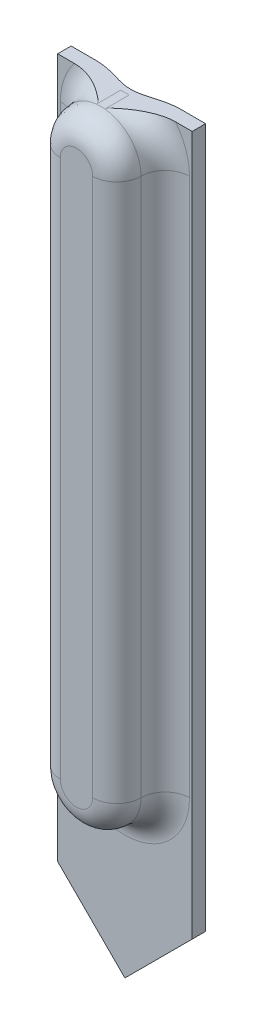
ISO-10303-21;
HEADER;
FILE_DESCRIPTION(('STEP AP214'),'2;1');
FILE_NAME('part.step','',(''),(''),'','','');
FILE_SCHEMA(('AUTOMOTIVE_DESIGN { 1 0 10303 214 1 1 1 1 }'));
ENDSEC;
DATA;
#1=APPLICATION_CONTEXT('core data for automotive mechanical design processes');
#2=APPLICATION_PROTOCOL_DEFINITION('international standard','automotive_design',2000,#1);
#3=PRODUCT_CONTEXT('',#1,'mechanical');
#4=PRODUCT('Part','Part','',(#3));
#5=PRODUCT_RELATED_PRODUCT_CATEGORY('part','',(#4));
#6=PRODUCT_DEFINITION_FORMATION('','',#4);
#7=PRODUCT_DEFINITION_CONTEXT('part definition',#1,'design');
#8=PRODUCT_DEFINITION('design','',#6,#7);
#9=PRODUCT_DEFINITION_SHAPE('','',#8);
#10=(LENGTH_UNIT() NAMED_UNIT(*) SI_UNIT(.MILLI.,.METRE.));
#11=(NAMED_UNIT(*) PLANE_ANGLE_UNIT() SI_UNIT($,.RADIAN.));
#12=(NAMED_UNIT(*) SI_UNIT($,.STERADIAN.) SOLID_ANGLE_UNIT());
#13=UNCERTAINTY_MEASURE_WITH_UNIT(LENGTH_MEASURE(1.E-05),#10,'distance_accuracy_value','');
#14=(GEOMETRIC_REPRESENTATION_CONTEXT(3) GLOBAL_UNCERTAINTY_ASSIGNED_CONTEXT((#13)) GLOBAL_UNIT_ASSIGNED_CONTEXT((#10,
#11,#12)) REPRESENTATION_CONTEXT('',''));
#15=CARTESIAN_POINT('',(0.,0.,0.));
#16=DIRECTION('',(0.,0.,1.));
#17=DIRECTION('',(1.,0.,0.));
#18=AXIS2_PLACEMENT_3D('',#15,#16,#17);
#19=CARTESIAN_POINT('',(10.37274519616,0.9,-14.73102915295));
#20=DIRECTION('',(0.,0.,1.));
#21=DIRECTION('',(1.,0.,0.));
#22=AXIS2_PLACEMENT_3D('',#19,#20,#21);
#23=PLANE('',#22);
#24=CARTESIAN_POINT('',(10.37274519616,0.9,-14.73102915295));
#25=DIRECTION('',(0.,0.,-1.));
#26=DIRECTION('',(1.,0.,0.));
#27=AXIS2_PLACEMENT_3D('',#24,#25,#26);
#28=CIRCLE('',#27,0.119999999999999);
#29=CARTESIAN_POINT('',(10.49274519616,0.9,-14.73102915295));
#30=VERTEX_POINT('',#29);
#31=CARTESIAN_POINT('',(10.25274519616,0.9,-14.73102915295));
#32=VERTEX_POINT('',#31);
#33=EDGE_CURVE('E509',#30,#32,#28,.T.);
#34=ORIENTED_EDGE('',*,*,#33,.F.);
#35=DIRECTION('',(0.,-1.,0.));
#36=VECTOR('',#35,1.);
#37=CARTESIAN_POINT('',(10.49274519616,0.9,-14.73102915295));
#38=LINE('',#37,#36);
#39=CARTESIAN_POINT('',(10.49274519616,4.901639164853,-14.73102915295));
#40=VERTEX_POINT('',#39);
#41=EDGE_CURVE('E495',#40,#30,#38,.T.);
#42=ORIENTED_EDGE('',*,*,#41,.F.);
#43=CARTESIAN_POINT('',(10.37274519616,4.901639164853,-14.73102915295));
#44=DIRECTION('',(0.,0.,-1.));
#45=DIRECTION('',(-1.,0.,0.));
#46=AXIS2_PLACEMENT_3D('',#43,#44,#45);
#47=CIRCLE('',#46,0.119999999999999);
#48=CARTESIAN_POINT('',(10.25274519616,4.901639164853,-14.73102915295));
#49=VERTEX_POINT('',#48);
#50=EDGE_CURVE('E542',#40,#49,#47,.F.);
#51=ORIENTED_EDGE('',*,*,#50,.T.);
#52=DIRECTION('',(0.,1.,0.));
#53=VECTOR('',#52,1.);
#54=CARTESIAN_POINT('',(10.25274519616,0.9,-14.73102915295));
#55=LINE('',#54,#53);
#56=EDGE_CURVE('E494',#32,#49,#55,.T.);
#57=ORIENTED_EDGE('',*,*,#56,.F.);
#58=EDGE_LOOP('',(#34,#42,#51,#57));
#59=FACE_BOUND('',#58,.T.);
#60=ADVANCED_FACE('F17',(#59),#23,.T.);
#61=CARTESIAN_POINT('',(10.67274519616,0.9,-14.91102915295));
#62=CARTESIAN_POINT('',(10.67274519616,0.9,-14.86390526315));
#63=CARTESIAN_POINT('',(10.657944212677,0.9,-14.81678538282));
#64=CARTESIAN_POINT('',(10.628319423096,0.9,-14.77545492602));
#65=CARTESIAN_POINT('',(10.586988966287,0.9,-14.74583013643));
#66=CARTESIAN_POINT('',(10.539869085964,0.9,-14.73102915295));
#67=CARTESIAN_POINT('',(10.49274519616,0.9,-14.73102915295));
#68=(BOUNDED_CURVE() B_SPLINE_CURVE(6,(#61,#62,#63,#64,#65,#66,#67),.UNSPECIFIED.,.F.,
.F.) B_SPLINE_CURVE_WITH_KNOTS((7,7),(0.,1.570796326795),
.UNSPECIFIED.) CURVE() GEOMETRIC_REPRESENTATION_ITEM() RATIONAL_B_SPLINE_CURVE((1.,1.,1.,1.,1.,
1.,1.)) REPRESENTATION_ITEM(''));
#69=CARTESIAN_POINT('',(10.37274519616,0.9,-14.91102915295));
#70=DIRECTION('',(0.,0.,-1.));
#71=AXIS1_PLACEMENT('',#69,#70);
#72=SURFACE_OF_REVOLUTION('',#68,#71);
#73=ORIENTED_EDGE('',*,*,#33,.T.);
#74=CARTESIAN_POINT('',(10.25274519616,0.9,-14.91102915295));
#75=DIRECTION('',(0.,1.,0.));
#76=DIRECTION('',(0.,0.,1.));
#77=AXIS2_PLACEMENT_3D('',#74,#75,#76);
#78=CIRCLE('',#77,0.18);
#79=CARTESIAN_POINT('',(10.07274519616,0.9,-14.91102915295));
#80=VERTEX_POINT('',#79);
#81=EDGE_CURVE('E491',#80,#32,#78,.T.);
#82=ORIENTED_EDGE('',*,*,#81,.F.);
#83=CARTESIAN_POINT('',(10.37274519616,0.9,-14.91102915295));
#84=DIRECTION('',(0.,0.,-1.));
#85=DIRECTION('',(-1.,0.,0.));
#86=AXIS2_PLACEMENT_3D('',#83,#84,#85);
#87=CIRCLE('',#86,0.3);
#88=CARTESIAN_POINT('',(10.67274519616,0.9,-14.91102915295));
#89=VERTEX_POINT('',#88);
#90=EDGE_CURVE('E473',#80,#89,#87,.F.);
#91=ORIENTED_EDGE('',*,*,#90,.T.);
#92=CARTESIAN_POINT('',(10.49274519616,0.9,-14.91102915295));
#93=DIRECTION('',(0.,-1.,0.));
#94=DIRECTION('',(0.,0.,-1.));
#95=AXIS2_PLACEMENT_3D('',#92,#93,#94);
#96=CIRCLE('',#95,0.18);
#97=EDGE_CURVE('E506',#30,#89,#96,.F.);
#98=ORIENTED_EDGE('',*,*,#97,.F.);
#99=EDGE_LOOP('',(#73,#82,#91,#98));
#100=FACE_BOUND('',#99,.T.);
#101=ADVANCED_FACE('F523',(#100),#72,.F.);
#102=CARTESIAN_POINT('',(10.49274519616,0.9,-14.91102915295));
#103=DIRECTION('',(0.,-1.,0.));
#104=DIRECTION('',(0.,0.,-1.));
#105=AXIS2_PLACEMENT_3D('',#102,#103,#104);
#106=CYLINDRICAL_SURFACE('',#105,0.18);
#107=CARTESIAN_POINT('',(10.49274519616,4.901639164853,-14.91102915295));
#108=DIRECTION('',(0.,-1.,0.));
#109=DIRECTION('',(0.,0.,-1.));
#110=AXIS2_PLACEMENT_3D('',#107,#108,#109);
#111=CIRCLE('',#110,0.18);
#112=CARTESIAN_POINT('',(10.67274519616,4.901639164853,-14.91102915295));
#113=VERTEX_POINT('',#112);
#114=EDGE_CURVE('E508',#113,#40,#111,.T.);
#115=ORIENTED_EDGE('',*,*,#114,.T.);
#116=ORIENTED_EDGE('',*,*,#41,.T.);
#117=ORIENTED_EDGE('',*,*,#97,.T.);
#118=DIRECTION('',(0.,-1.,0.));
#119=VECTOR('',#118,1.);
#120=CARTESIAN_POINT('',(10.67274519616,0.9,-14.91102915295));
#121=LINE('',#120,#119);
#122=EDGE_CURVE('E481',#89,#113,#121,.F.);
#123=ORIENTED_EDGE('',*,*,#122,.T.);
#124=EDGE_LOOP('',(#115,#116,#117,#123));
#125=FACE_BOUND('',#124,.T.);
#126=ADVANCED_FACE('F527',(#125),#106,.T.);
#127=CARTESIAN_POINT('',(10.25274519616,0.9,-14.91102915295));
#128=DIRECTION('',(0.,1.,0.));
#129=DIRECTION('',(0.,0.,1.));
#130=AXIS2_PLACEMENT_3D('',#127,#128,#129);
#131=CYLINDRICAL_SURFACE('',#130,0.18);
#132=CARTESIAN_POINT('',(10.25274519616,4.901639164853,-14.91102915295));
#133=DIRECTION('',(0.,1.,0.));
#134=DIRECTION('',(0.,0.,1.));
#135=AXIS2_PLACEMENT_3D('',#132,#133,#134);
#136=CIRCLE('',#135,0.18);
#137=CARTESIAN_POINT('',(10.07274519616,4.901639164853,-14.91102915295));
#138=VERTEX_POINT('',#137);
#139=EDGE_CURVE('E482',#49,#138,#136,.F.);
#140=ORIENTED_EDGE('',*,*,#139,.T.);
#141=DIRECTION('',(0.,1.,0.));
#142=VECTOR('',#141,1.);
#143=CARTESIAN_POINT('',(10.07274519616,0.9,-14.91102915295));
#144=LINE('',#143,#142);
#145=EDGE_CURVE('E485',#138,#80,#144,.F.);
#146=ORIENTED_EDGE('',*,*,#145,.T.);
#147=ORIENTED_EDGE('',*,*,#81,.T.);
#148=ORIENTED_EDGE('',*,*,#56,.T.);
#149=EDGE_LOOP('',(#140,#146,#147,#148));
#150=FACE_BOUND('',#149,.T.);
#151=ADVANCED_FACE('F766',(#150),#131,.T.);
#152=CARTESIAN_POINT('',(10.37274519616,0.9,-14.91102915295));
#153=DIRECTION('',(0.,0.,-1.));
#154=DIRECTION('',(-1.,0.,0.));
#155=AXIS2_PLACEMENT_3D('',#152,#153,#154);
#156=TOROIDAL_SURFACE('',#155,0.48,0.18);
#157=ORIENTED_EDGE('',*,*,#90,.F.);
#158=CARTESIAN_POINT('',(9.89274519616,0.9,-14.91102915295));
#159=DIRECTION('',(0.,1.,0.));
#160=DIRECTION('',(0.,0.,1.));
#161=AXIS2_PLACEMENT_3D('',#158,#159,#160);
#162=CIRCLE('',#161,0.18);
#163=CARTESIAN_POINT('',(9.89274519616,0.9,-15.09102915295));
#164=VERTEX_POINT('',#163);
#165=EDGE_CURVE('E488',#80,#164,#162,.T.);
#166=ORIENTED_EDGE('',*,*,#165,.T.);
#167=CARTESIAN_POINT('',(10.37274519616,0.9,-15.09102915295));
#168=DIRECTION('',(0.,0.,1.));
#169=DIRECTION('',(-1.,0.,0.));
#170=AXIS2_PLACEMENT_3D('',#167,#168,#169);
#171=CIRCLE('',#170,0.48);
#172=CARTESIAN_POINT('',(10.85274519616,0.9,-15.09102915295));
#173=VERTEX_POINT('',#172);
#174=EDGE_CURVE('E434',#164,#173,#171,.T.);
#175=ORIENTED_EDGE('',*,*,#174,.T.);
#176=CARTESIAN_POINT('',(10.85274519616,0.9,-14.91102915295));
#177=DIRECTION('',(0.,-1.,0.));
#178=DIRECTION('',(0.,0.,-1.));
#179=AXIS2_PLACEMENT_3D('',#176,#177,#178);
#180=CIRCLE('',#179,0.18);
#181=EDGE_CURVE('E749',#173,#89,#180,.F.);
#182=ORIENTED_EDGE('',*,*,#181,.T.);
#183=EDGE_LOOP('',(#157,#166,#175,#182));
#184=FACE_BOUND('',#183,.T.);
#185=ADVANCED_FACE('F745',(#184),#156,.F.);
#186=CARTESIAN_POINT('',(10.85274519616,0.9,-14.91102915295));
#187=DIRECTION('',(0.,-1.,0.));
#188=DIRECTION('',(0.,0.,-1.));
#189=AXIS2_PLACEMENT_3D('',#186,#187,#188);
#190=CYLINDRICAL_SURFACE('',#189,0.18);
#191=DIRECTION('',(0.,1.,0.));
#192=VECTOR('',#191,1.);
#193=CARTESIAN_POINT('',(10.85274519616,5.2,-15.09102915295));
#194=LINE('',#193,#192);
#195=CARTESIAN_POINT('',(10.8527451961601,4.901639164853,-15.09102915295));
#196=VERTEX_POINT('',#195);
#197=EDGE_CURVE('E395',#173,#196,#194,.T.);
#198=ORIENTED_EDGE('',*,*,#197,.T.);
#199=CARTESIAN_POINT('',(10.85274519616,4.901639164853,-14.91102915295));
#200=DIRECTION('',(0.,-1.,0.));
#201=DIRECTION('',(0.,0.,-1.));
#202=AXIS2_PLACEMENT_3D('',#199,#200,#201);
#203=CIRCLE('',#202,0.18);
#204=EDGE_CURVE('E503',#113,#196,#203,.T.);
#205=ORIENTED_EDGE('',*,*,#204,.F.);
#206=ORIENTED_EDGE('',*,*,#122,.F.);
#207=ORIENTED_EDGE('',*,*,#181,.F.);
#208=EDGE_LOOP('',(#198,#205,#206,#207));
#209=FACE_BOUND('',#208,.T.);
#210=ADVANCED_FACE('F765',(#209),#190,.F.);
#211=CARTESIAN_POINT('',(9.89274519616,0.9,-14.91102915295));
#212=DIRECTION('',(0.,1.,0.));
#213=DIRECTION('',(0.,0.,1.));
#214=AXIS2_PLACEMENT_3D('',#211,#212,#213);
#215=CYLINDRICAL_SURFACE('',#214,0.18);
#216=ORIENTED_EDGE('',*,*,#145,.F.);
#217=CARTESIAN_POINT('',(9.89274519616,4.901639164853,-14.91102915295));
#218=DIRECTION('',(0.,1.,0.));
#219=DIRECTION('',(0.,0.,1.));
#220=AXIS2_PLACEMENT_3D('',#217,#218,#219);
#221=CIRCLE('',#220,0.18);
#222=CARTESIAN_POINT('',(9.89274519616,4.901639164853,-15.09102915295));
#223=VERTEX_POINT('',#222);
#224=EDGE_CURVE('E164',#223,#138,#221,.F.);
#225=ORIENTED_EDGE('',*,*,#224,.F.);
#226=DIRECTION('',(0.,1.,0.));
#227=VECTOR('',#226,1.);
#228=CARTESIAN_POINT('',(9.89274519616,5.2,-15.09102915295));
#229=LINE('',#228,#227);
#230=EDGE_CURVE('E170',#223,#164,#229,.F.);
#231=ORIENTED_EDGE('',*,*,#230,.T.);
#232=ORIENTED_EDGE('',*,*,#165,.F.);
#233=EDGE_LOOP('',(#216,#225,#231,#232));
#234=FACE_BOUND('',#233,.T.);
#235=ADVANCED_FACE('F555',(#234),#215,.F.);
#236=CARTESIAN_POINT('',(10.67274519616,4.901639164853,-14.91102915295));
#237=CARTESIAN_POINT('',(10.67274519616,4.901639164853,-14.86390526315));
#238=CARTESIAN_POINT('',(10.657944212677,4.901639164853,-14.81678538282));
#239=CARTESIAN_POINT('',(10.628319423096,4.901639164853,-14.77545492602));
#240=CARTESIAN_POINT('',(10.586988966287,4.901639164853,-14.74583013643));
#241=CARTESIAN_POINT('',(10.539869085964,4.901639164853,-14.73102915295));
#242=CARTESIAN_POINT('',(10.49274519616,4.901639164853,-14.73102915295));
#243=(BOUNDED_CURVE() B_SPLINE_CURVE(6,(#236,#237,#238,#239,#240,#241,#242),.UNSPECIFIED.,.F.,
.F.) B_SPLINE_CURVE_WITH_KNOTS((7,7),(0.,1.570796326795),
.UNSPECIFIED.) CURVE() GEOMETRIC_REPRESENTATION_ITEM() RATIONAL_B_SPLINE_CURVE((1.,1.,1.,1.,1.,
1.,1.)) REPRESENTATION_ITEM(''));
#244=CARTESIAN_POINT('',(10.37274519616,4.901639164853,-14.91102915295));
#245=DIRECTION('',(0.,0.,-1.));
#246=AXIS1_PLACEMENT('',#244,#245);
#247=SURFACE_OF_REVOLUTION('',#243,#246);
#248=ORIENTED_EDGE('',*,*,#50,.F.);
#249=ORIENTED_EDGE('',*,*,#114,.F.);
#250=CARTESIAN_POINT('',(10.37274519616,4.901639164853,-14.91102915295));
#251=DIRECTION('',(0.,0.,-1.));
#252=DIRECTION('',(-1.,0.,0.));
#253=AXIS2_PLACEMENT_3D('',#250,#251,#252);
#254=CIRCLE('',#253,0.3);
#255=CARTESIAN_POINT('',(10.4040631151635,5.19999999999949,-14.91102915295));
#256=VERTEX_POINT('',#255);
#257=EDGE_CURVE('E187',#113,#256,#254,.F.);
#258=ORIENTED_EDGE('',*,*,#257,.T.);
#259=CARTESIAN_POINT('',(10.37274519616,4.901639164853,-14.91102915295));
#260=DIRECTION('',(0.,0.,-1.));
#261=DIRECTION('',(-1.,0.,0.));
#262=AXIS2_PLACEMENT_3D('',#259,#260,#261);
#263=CIRCLE('',#262,0.3);
#264=CARTESIAN_POINT('',(10.3414272771568,5.19999999999949,-14.91102915295));
#265=VERTEX_POINT('',#264);
#266=EDGE_CURVE('E183',#265,#256,#263,.T.);
#267=ORIENTED_EDGE('',*,*,#266,.F.);
#268=CARTESIAN_POINT('',(10.37274519616,4.901639164853,-14.91102915295));
#269=DIRECTION('',(0.,0.,-1.));
#270=DIRECTION('',(-1.,0.,0.));
#271=AXIS2_PLACEMENT_3D('',#268,#269,#270);
#272=CIRCLE('',#271,0.3);
#273=EDGE_CURVE('E159',#265,#138,#272,.F.);
#274=ORIENTED_EDGE('',*,*,#273,.T.);
#275=ORIENTED_EDGE('',*,*,#139,.F.);
#276=EDGE_LOOP('',(#248,#249,#258,#267,#274,#275));
#277=FACE_BOUND('',#276,.T.);
#278=ADVANCED_FACE('F185',(#277),#247,.F.);
#279=CARTESIAN_POINT('',(10.37274519616,0.9,-14.83102915295));
#280=DIRECTION('',(0.,0.,1.));
#281=DIRECTION('',(1.,0.,0.));
#282=AXIS2_PLACEMENT_3D('',#279,#280,#281);
#283=PLANE('',#282);
#284=DIRECTION('',(0.,1.,0.));
#285=VECTOR('',#284,1.);
#286=CARTESIAN_POINT('',(10.44274519616,0.9,-14.83102915295));
#287=LINE('',#286,#285);
#288=CARTESIAN_POINT('',(10.44274519616,4.901639164853,-14.83102915295));
#289=VERTEX_POINT('',#288);
#290=CARTESIAN_POINT('',(10.44274519616,0.9,-14.83102915295));
#291=VERTEX_POINT('',#290);
#292=EDGE_CURVE('E376',#289,#291,#287,.F.);
#293=ORIENTED_EDGE('',*,*,#292,.T.);
#294=CARTESIAN_POINT('',(10.37274519616,0.9,-14.83102915295));
#295=DIRECTION('',(0.,0.,1.));
#296=DIRECTION('',(-1.,0.,0.));
#297=AXIS2_PLACEMENT_3D('',#294,#295,#296);
#298=CIRCLE('',#297,0.0700000000000006);
#299=CARTESIAN_POINT('',(10.30274519616,0.9,-14.83102915295));
#300=VERTEX_POINT('',#299);
#301=EDGE_CURVE('E584',#291,#300,#298,.F.);
#302=ORIENTED_EDGE('',*,*,#301,.T.);
#303=DIRECTION('',(0.,-1.,0.));
#304=VECTOR('',#303,1.);
#305=CARTESIAN_POINT('',(10.30274519616,0.9,-14.83102915295));
#306=LINE('',#305,#304);
#307=CARTESIAN_POINT('',(10.30274519616,4.901639164853,-14.83102915295));
#308=VERTEX_POINT('',#307);
#309=EDGE_CURVE('E447',#300,#308,#306,.F.);
#310=ORIENTED_EDGE('',*,*,#309,.T.);
#311=CARTESIAN_POINT('',(10.37274519616,4.901639164853,-14.83102915295));
#312=DIRECTION('',(0.,0.,1.));
#313=DIRECTION('',(1.,0.,0.));
#314=AXIS2_PLACEMENT_3D('',#311,#312,#313);
#315=CIRCLE('',#314,0.0700000000000006);
#316=EDGE_CURVE('E377',#308,#289,#315,.F.);
#317=ORIENTED_EDGE('',*,*,#316,.T.);
#318=EDGE_LOOP('',(#293,#302,#310,#317));
#319=FACE_BOUND('',#318,.T.);
#320=ADVANCED_FACE('F463',(#319),#283,.F.);
#321=CARTESIAN_POINT('',(10.62274519616,0.9,-15.01102915295));
#322=CARTESIAN_POINT('',(10.62274519616,0.9,-14.96390526315));
#323=CARTESIAN_POINT('',(10.607944212677,0.9,-14.91678538282));
#324=CARTESIAN_POINT('',(10.578319423096,0.9,-14.87545492602));
#325=CARTESIAN_POINT('',(10.536988966287,0.9,-14.84583013643));
#326=CARTESIAN_POINT('',(10.489869085964,0.9,-14.83102915295));
#327=CARTESIAN_POINT('',(10.44274519616,0.9,-14.83102915295));
#328=(BOUNDED_CURVE() B_SPLINE_CURVE(6,(#321,#322,#323,#324,#325,#326,#327),.UNSPECIFIED.,.F.,
.F.) B_SPLINE_CURVE_WITH_KNOTS((7,7),(0.,1.570796326795),
.UNSPECIFIED.) CURVE() GEOMETRIC_REPRESENTATION_ITEM() RATIONAL_B_SPLINE_CURVE((1.,1.,1.,1.,1.,
1.,1.)) REPRESENTATION_ITEM(''));
#329=CARTESIAN_POINT('',(10.37274519616,0.9,-15.01102915295));
#330=DIRECTION('',(0.,0.,-1.));
#331=AXIS1_PLACEMENT('',#329,#330);
#332=SURFACE_OF_REVOLUTION('',#328,#331);
#333=ORIENTED_EDGE('',*,*,#301,.F.);
#334=CARTESIAN_POINT('',(10.44274519616,0.9,-15.01102915295));
#335=DIRECTION('',(0.,1.,0.));
#336=DIRECTION('',(0.,0.,1.));
#337=AXIS2_PLACEMENT_3D('',#334,#335,#336);
#338=CIRCLE('',#337,0.18);
#339=CARTESIAN_POINT('',(10.62274519616,0.9,-15.01102915295));
#340=VERTEX_POINT('',#339);
#341=EDGE_CURVE('E382',#291,#340,#338,.T.);
#342=ORIENTED_EDGE('',*,*,#341,.T.);
#343=CARTESIAN_POINT('',(10.37274519616,0.9,-15.01102915295));
#344=DIRECTION('',(0.,0.,1.));
#345=DIRECTION('',(1.,0.,0.));
#346=AXIS2_PLACEMENT_3D('',#343,#344,#345);
#347=CIRCLE('',#346,0.25);
#348=CARTESIAN_POINT('',(10.12274519616,0.9,-15.01102915295));
#349=VERTEX_POINT('',#348);
#350=EDGE_CURVE('E606',#349,#340,#347,.T.);
#351=ORIENTED_EDGE('',*,*,#350,.F.);
#352=CARTESIAN_POINT('',(10.30274519616,0.9,-15.01102915295));
#353=DIRECTION('',(0.,-1.,0.));
#354=DIRECTION('',(0.,0.,-1.));
#355=AXIS2_PLACEMENT_3D('',#352,#353,#354);
#356=CIRCLE('',#355,0.18);
#357=EDGE_CURVE('E444',#349,#300,#356,.F.);
#358=ORIENTED_EDGE('',*,*,#357,.T.);
#359=EDGE_LOOP('',(#333,#342,#351,#358));
#360=FACE_BOUND('',#359,.T.);
#361=ADVANCED_FACE('F458',(#360),#332,.T.);
#362=CARTESIAN_POINT('',(10.30274519616,0.9,-15.01102915295));
#363=DIRECTION('',(0.,-1.,0.));
#364=DIRECTION('',(0.,0.,-1.));
#365=AXIS2_PLACEMENT_3D('',#362,#363,#364);
#366=CYLINDRICAL_SURFACE('',#365,0.18);
#367=DIRECTION('',(0.,1.,0.));
#368=VECTOR('',#367,1.);
#369=CARTESIAN_POINT('',(10.12274519616,0.9,-15.01102915295));
#370=LINE('',#369,#368);
#371=CARTESIAN_POINT('',(10.12274519616,4.901639164853,-15.01102915295));
#372=VERTEX_POINT('',#371);
#373=EDGE_CURVE('E608',#372,#349,#370,.F.);
#374=ORIENTED_EDGE('',*,*,#373,.F.);
#375=CARTESIAN_POINT('',(10.30274519616,4.901639164853,-15.01102915295));
#376=DIRECTION('',(0.,-1.,0.));
#377=DIRECTION('',(0.,0.,-1.));
#378=AXIS2_PLACEMENT_3D('',#375,#376,#377);
#379=CIRCLE('',#378,0.18);
#380=EDGE_CURVE('E374',#372,#308,#379,.F.);
#381=ORIENTED_EDGE('',*,*,#380,.T.);
#382=ORIENTED_EDGE('',*,*,#309,.F.);
#383=ORIENTED_EDGE('',*,*,#357,.F.);
#384=EDGE_LOOP('',(#374,#381,#382,#383));
#385=FACE_BOUND('',#384,.T.);
#386=ADVANCED_FACE('F462',(#385),#366,.F.);
#387=CARTESIAN_POINT('',(9.87274519616,5.2,-15.09102915295));
#388=DIRECTION('',(0.,0.,-1.));
#389=DIRECTION('',(-1.,0.,0.));
#390=AXIS2_PLACEMENT_3D('',#387,#388,#389);
#391=PLANE('',#390);
#392=CARTESIAN_POINT('',(10.37274519616,4.901639164853,-15.09102915295));
#393=DIRECTION('',(0.,0.,1.));
#394=DIRECTION('',(-0.783346664475921,0.621585073223649,0.));
#395=AXIS2_PLACEMENT_3D('',#392,#393,#394);
#396=CIRCLE('',#395,0.480000000000002);
#397=CARTESIAN_POINT('',(9.99673879721191,5.20000000000007,-15.09102915295));
#398=VERTEX_POINT('',#397);
#399=EDGE_CURVE('E169',#223,#398,#396,.F.);
#400=ORIENTED_EDGE('',*,*,#399,.T.);
#401=DIRECTION('',(-1.,0.,0.));
#402=VECTOR('',#401,1.);
#403=CARTESIAN_POINT('',(9.87274519616,5.2,-15.09102915295));
#404=LINE('',#403,#402);
#405=CARTESIAN_POINT('',(9.87274519616,5.2,-15.09102915295));
#406=VERTEX_POINT('',#405);
#407=EDGE_CURVE('E178',#406,#398,#404,.F.);
#408=ORIENTED_EDGE('',*,*,#407,.F.);
#409=DIRECTION('',(0.,1.,0.));
#410=VECTOR('',#409,1.);
#411=CARTESIAN_POINT('',(9.87274519616,5.2,-15.09102915295));
#412=LINE('',#411,#410);
#413=CARTESIAN_POINT('',(9.87274519616,0.,-15.09102915295));
#414=VERTEX_POINT('',#413);
#415=EDGE_CURVE('E243',#406,#414,#412,.F.);
#416=ORIENTED_EDGE('',*,*,#415,.T.);
#417=DIRECTION('',(-0.707106781186548,0.707106781186548,0.));
#418=VECTOR('',#417,1.);
#419=CARTESIAN_POINT('',(9.87274519616,0.,-15.09102915295));
#420=LINE('',#419,#418);
#421=CARTESIAN_POINT('',(10.37274519616,-0.499999999999999,-15.09102915295));
#422=VERTEX_POINT('',#421);
#423=EDGE_CURVE('E242',#414,#422,#420,.F.);
#424=ORIENTED_EDGE('',*,*,#423,.T.);
#425=DIRECTION('',(-0.707106781186548,-0.707106781186548,0.));
#426=VECTOR('',#425,1.);
#427=CARTESIAN_POINT('',(10.87274519616,0.,-15.09102915295));
#428=LINE('',#427,#426);
#429=CARTESIAN_POINT('',(10.87274519616,0.,-15.09102915295));
#430=VERTEX_POINT('',#429);
#431=EDGE_CURVE('E231',#422,#430,#428,.F.);
#432=ORIENTED_EDGE('',*,*,#431,.T.);
#433=DIRECTION('',(0.,1.,0.));
#434=VECTOR('',#433,1.);
#435=CARTESIAN_POINT('',(10.87274519616,5.2,-15.09102915295));
#436=LINE('',#435,#434);
#437=CARTESIAN_POINT('',(10.87274519616,5.2,-15.09102915295));
#438=VERTEX_POINT('',#437);
#439=EDGE_CURVE('E220',#430,#438,#436,.T.);
#440=ORIENTED_EDGE('',*,*,#439,.T.);
#441=DIRECTION('',(-1.,0.,0.));
#442=VECTOR('',#441,1.);
#443=CARTESIAN_POINT('',(9.87274519616,5.2,-15.09102915295));
#444=LINE('',#443,#442);
#445=CARTESIAN_POINT('',(10.748751595109,5.2,-15.09102915295));
#446=VERTEX_POINT('',#445);
#447=EDGE_CURVE('E398',#446,#438,#444,.F.);
#448=ORIENTED_EDGE('',*,*,#447,.F.);
#449=CARTESIAN_POINT('',(10.37274519616,4.901639164853,-15.09102915295));
#450=DIRECTION('',(0.,0.,1.));
#451=DIRECTION('',(1.,0.,0.));
#452=AXIS2_PLACEMENT_3D('',#449,#450,#451);
#453=CIRCLE('',#452,0.48000000000022);
#454=EDGE_CURVE('E335',#446,#196,#453,.F.);
#455=ORIENTED_EDGE('',*,*,#454,.T.);
#456=ORIENTED_EDGE('',*,*,#197,.F.);
#457=ORIENTED_EDGE('',*,*,#174,.F.);
#458=ORIENTED_EDGE('',*,*,#230,.F.);
#459=EDGE_LOOP('',(#400,#408,#416,#424,#432,#440,#448,#455,#456,#457,#458));
#460=FACE_BOUND('',#459,.T.);
#461=ADVANCED_FACE('F360',(#460),#391,.F.);
#462=CARTESIAN_POINT('',(10.37274519616,4.901639164853,-14.91102915295));
#463=DIRECTION('',(0.,0.,-1.));
#464=DIRECTION('',(-1.,0.,0.));
#465=AXIS2_PLACEMENT_3D('',#462,#463,#464);
#466=TOROIDAL_SURFACE('',#465,0.48,0.18);
#467=ORIENTED_EDGE('',*,*,#399,.F.);
#468=ORIENTED_EDGE('',*,*,#224,.T.);
#469=ORIENTED_EDGE('',*,*,#273,.F.);
#470=CARTESIAN_POINT('',(9.99673879721191,5.2,-15.09102915295));
#471=CARTESIAN_POINT('',(10.0159411263741,5.2,-15.0910223833909));
#472=CARTESIAN_POINT('',(10.0350229168067,5.2,-15.0891513636791));
#473=CARTESIAN_POINT('',(10.0724295317097,5.2,-15.082384117675));
#474=CARTESIAN_POINT('',(10.0907605792799,5.2,-15.077523332793));
#475=CARTESIAN_POINT('',(10.1371160607757,5.2,-15.0619101240788));
#476=CARTESIAN_POINT('',(10.1645247119352,5.20000000000001,-15.0493743525125));
#477=CARTESIAN_POINT('',(10.2040517116441,5.2,-15.0276951570126));
#478=CARTESIAN_POINT('',(10.2170031676026,5.19999999999999,-15.0199591413941));
#479=CARTESIAN_POINT('',(10.2424118418147,5.20000000000001,-15.0037131668277));
#480=CARTESIAN_POINT('',(10.2548692594253,5.20000000000003,-14.9952035247171));
#481=CARTESIAN_POINT('',(10.2728507368725,5.19999999999999,-14.9821732518184));
#482=CARTESIAN_POINT('',(10.2785681254431,5.19999999999996,-14.9779144009825));
#483=CARTESIAN_POINT('',(10.2898595085868,5.20000000000004,-14.9692490742599));
#484=CARTESIAN_POINT('',(10.2954339401581,5.20000000000015,-14.9648431761195));
#485=CARTESIAN_POINT('',(10.3043668688461,5.2000000000001,-14.9575013616405));
#486=CARTESIAN_POINT('',(10.3077778702744,5.20000000000003,-14.9546287027329));
#487=CARTESIAN_POINT('',(10.3145230116715,5.19999999999997,-14.9487494447429));
#488=CARTESIAN_POINT('',(10.3178565735601,5.19999999999999,-14.9457421504186));
#489=CARTESIAN_POINT('',(10.3243723656529,5.20000000000001,-14.9395127122063));
#490=CARTESIAN_POINT('',(10.3275526553233,5.2,-14.9362886549278));
#491=CARTESIAN_POINT('',(10.3335174998326,5.2,-14.9294818151388));
#492=CARTESIAN_POINT('',(10.3363057535006,5.2,-14.9259030183493));
#493=CARTESIAN_POINT('',(10.3390205914806,5.2,-14.9207684147761));
#494=CARTESIAN_POINT('',(10.3395780768273,5.2,-14.919567252179));
#495=CARTESIAN_POINT('',(10.3404981521625,5.2,-14.9170964725954));
#496=CARTESIAN_POINT('',(10.3408618607657,5.2,-14.9158272961034));
#497=CARTESIAN_POINT('',(10.3413161737638,5.2,-14.9133811195636));
#498=CARTESIAN_POINT('',(10.3414315878544,5.2,-14.9122085618147));
#499=CARTESIAN_POINT('',(10.3414272771617,5.2,-14.91102915295));
#500=B_SPLINE_CURVE_WITH_KNOTS('',3,(#470,#471,#472,#473,#474,#475,#476,#477,#478,#479,#480,
#481,#482,#483,#484,#485,#486,#487,#488,#489,#490,#491,#492,#493,#494,#495,#496,#497,#498,#499),
.UNSPECIFIED.,.F.,.F.,(4,2,2,2,2,2,2,2,2,2,2,2,2,2,4),(0.,0.0573405628780699,0.114014158044661,
0.203904721623418,0.249149856576272,0.294376544231532,0.315763187924544,0.337073908405486,
0.350452507008674,0.363910707883435,0.37750924750884,0.390969361003875,0.394930749156877,
0.398869014596356,0.402390882706175),.UNSPECIFIED.);
#501=EDGE_CURVE('E163',#398,#265,#500,.T.);
#502=ORIENTED_EDGE('',*,*,#501,.F.);
#503=EDGE_LOOP('',(#467,#468,#469,#502));
#504=FACE_BOUND('',#503,.T.);
#505=ADVANCED_FACE('F162',(#504),#466,.F.);
#506=CARTESIAN_POINT('',(10.37274519616,4.901639164853,-14.73102915295));
#507=DIRECTION('',(0.,0.,-1.));
#508=DIRECTION('',(-1.,0.,0.));
#509=AXIS2_PLACEMENT_3D('',#506,#507,#508);
#510=CYLINDRICAL_SURFACE('',#509,0.3);
#511=ORIENTED_EDGE('',*,*,#266,.T.);
#512=DIRECTION('',(0.,0.,1.));
#513=VECTOR('',#512,1.);
#514=CARTESIAN_POINT('',(10.404063115159,5.2,0.));
#515=LINE('',#514,#513);
#516=CARTESIAN_POINT('',(10.404063115159,5.19999999999998,-15.09102915295));
#517=VERTEX_POINT('',#516);
#518=EDGE_CURVE('E197',#517,#256,#515,.T.);
#519=ORIENTED_EDGE('',*,*,#518,.F.);
#520=CARTESIAN_POINT('',(10.341427277152,5.2,-15.09102915295));
#521=DIRECTION('',(1.,0.,0.));
#522=VECTOR('',#521,1.);
#523=LINE('',#520,#522);
#524=CARTESIAN_POINT('',(10.341427277155,5.19999999999998,-15.09102915295));
#525=VERTEX_POINT('',#524);
#526=EDGE_CURVE('E194',#525,#517,#523,.T.);
#527=ORIENTED_EDGE('',*,*,#526,.F.);
#528=DIRECTION('',(0.,0.,1.));
#529=VECTOR('',#528,1.);
#530=CARTESIAN_POINT('',(10.341427277152,5.2,0.));
#531=LINE('',#530,#529);
#532=EDGE_CURVE('E175',#265,#525,#531,.F.);
#533=ORIENTED_EDGE('',*,*,#532,.F.);
#534=EDGE_LOOP('',(#511,#519,#527,#533));
#535=FACE_BOUND('',#534,.T.);
#536=ADVANCED_FACE('F193',(#535),#510,.T.);
#537=CARTESIAN_POINT('',(10.37274519616,4.901639164853,-14.91102915295));
#538=DIRECTION('',(0.,0.,-1.));
#539=DIRECTION('',(-1.,0.,0.));
#540=AXIS2_PLACEMENT_3D('',#537,#538,#539);
#541=TOROIDAL_SURFACE('',#540,0.48,0.18);
#542=CARTESIAN_POINT('',(10.4040631151583,5.2,-14.91102915295));
#543=CARTESIAN_POINT('',(10.4040870124276,5.2,-14.9135851000173));
#544=CARTESIAN_POINT('',(10.4046008062486,5.2,-14.9160097655934));
#545=CARTESIAN_POINT('',(10.4067589396175,5.2,-14.9218958459267));
#546=CARTESIAN_POINT('',(10.408869246327,5.2,-14.925195192702));
#547=CARTESIAN_POINT('',(10.4135684296972,5.2,-14.9314196124082));
#548=CARTESIAN_POINT('',(10.4161665657933,5.2,-14.9343351855136));
#549=CARTESIAN_POINT('',(10.4215775181289,5.2,-14.9399654634065));
#550=CARTESIAN_POINT('',(10.4243897765864,5.2,-14.9426806561033));
#551=CARTESIAN_POINT('',(10.433006991943,5.2,-14.9506634507879));
#552=CARTESIAN_POINT('',(10.4389730596327,5.2,-14.9557471514157));
#553=CARTESIAN_POINT('',(10.4571191148,5.2,-14.9706200517779));
#554=CARTESIAN_POINT('',(10.4695813981772,5.2,-14.9800639724795));
#555=CARTESIAN_POINT('',(10.4950197946692,5.2,-14.9982477285734));
#556=CARTESIAN_POINT('',(10.5079963162944,5.2,-15.0069869867541));
#557=CARTESIAN_POINT('',(10.5344563263432,5.2,-15.0235799229912));
#558=CARTESIAN_POINT('',(10.5479381723063,5.2,-15.0314361859305));
#559=CARTESIAN_POINT('',(10.575466227256,5.2,-15.0460614700908));
#560=CARTESIAN_POINT('',(10.5895118639385,5.2,-15.0528315606547));
#561=CARTESIAN_POINT('',(10.6231270538599,5.19999999999999,-15.0671132347736));
#562=CARTESIAN_POINT('',(10.6429354199028,5.19999999999997,-15.0740793994377));
#563=CARTESIAN_POINT('',(10.6833934979367,5.20000000000003,-15.084734042775));
#564=CARTESIAN_POINT('',(10.7040395659452,5.20000000000011,-15.0884353970925));
#565=CARTESIAN_POINT('',(10.7327884862465,5.19999999999996,-15.0907040252069));
#566=CARTESIAN_POINT('',(10.740768251458,5.19999999999989,-15.0910300720402));
#567=CARTESIAN_POINT('',(10.748751595109,5.19999999999978,-15.09102915295));
#568=B_SPLINE_CURVE_WITH_KNOTS('',3,(#542,#543,#544,#545,#546,#547,#548,#549,#550,#551,#552,
#553,#554,#555,#556,#557,#558,#559,#560,#561,#562,#563,#564,#565,#566,#567),.UNSPECIFIED.,.F.,
.F.,(4,2,2,2,2,2,2,2,2,2,2,2,4),(0.,0.00741980527200788,0.0189151215652871,0.0306559780490882,
0.0423672326868301,0.0658750897617844,0.112748302535484,0.159659528637261,0.206429638380605,
0.253153416328442,0.315942381538735,0.378482600185046,0.402423321764405),.UNSPECIFIED.);
#569=EDGE_CURVE('E207',#256,#446,#568,.T.);
#570=ORIENTED_EDGE('',*,*,#569,.F.);
#571=ORIENTED_EDGE('',*,*,#257,.F.);
#572=ORIENTED_EDGE('',*,*,#204,.T.);
#573=ORIENTED_EDGE('',*,*,#454,.F.);
#574=EDGE_LOOP('',(#570,#571,#572,#573));
#575=FACE_BOUND('',#574,.T.);
#576=ADVANCED_FACE('F314',(#575),#541,.F.);
#577=CARTESIAN_POINT('',(10.62274519616,4.901639164853,-15.01102915295));
#578=CARTESIAN_POINT('',(10.62274519616,4.901639164853,-14.96390526315));
#579=CARTESIAN_POINT('',(10.607944212677,4.901639164853,-14.91678538282));
#580=CARTESIAN_POINT('',(10.578319423096,4.901639164853,-14.87545492602));
#581=CARTESIAN_POINT('',(10.536988966287,4.901639164853,-14.84583013643));
#582=CARTESIAN_POINT('',(10.489869085964,4.901639164853,-14.83102915295));
#583=CARTESIAN_POINT('',(10.44274519616,4.901639164853,-14.83102915295));
#584=(BOUNDED_CURVE() B_SPLINE_CURVE(6,(#577,#578,#579,#580,#581,#582,#583),.UNSPECIFIED.,.F.,
.F.) B_SPLINE_CURVE_WITH_KNOTS((7,7),(0.,1.570796326795),
.UNSPECIFIED.) CURVE() GEOMETRIC_REPRESENTATION_ITEM() RATIONAL_B_SPLINE_CURVE((1.,1.,1.,1.,1.,
1.,1.)) REPRESENTATION_ITEM(''));
#585=CARTESIAN_POINT('',(10.37274519616,4.901639164853,-15.01102915295));
#586=DIRECTION('',(0.,0.,-1.));
#587=AXIS1_PLACEMENT('',#585,#586);
#588=SURFACE_OF_REVOLUTION('',#584,#587);
#589=CARTESIAN_POINT('',(10.37274519616,4.901639164853,-15.01102915295));
#590=DIRECTION('',(0.,0.,1.));
#591=DIRECTION('',(1.,0.,0.));
#592=AXIS2_PLACEMENT_3D('',#589,#590,#591);
#593=CIRCLE('',#592,0.25);
#594=CARTESIAN_POINT('',(10.62274519616,4.901639164853,-15.01102915295));
#595=VERTEX_POINT('',#594);
#596=EDGE_CURVE('E620',#595,#372,#593,.T.);
#597=ORIENTED_EDGE('',*,*,#596,.F.);
#598=CARTESIAN_POINT('',(10.44274519616,4.901639164853,-15.01102915295));
#599=DIRECTION('',(0.,1.,0.));
#600=DIRECTION('',(0.,0.,1.));
#601=AXIS2_PLACEMENT_3D('',#598,#599,#600);
#602=CIRCLE('',#601,0.18);
#603=EDGE_CURVE('E636',#595,#289,#602,.F.);
#604=ORIENTED_EDGE('',*,*,#603,.T.);
#605=ORIENTED_EDGE('',*,*,#316,.F.);
#606=ORIENTED_EDGE('',*,*,#380,.F.);
#607=EDGE_LOOP('',(#597,#604,#605,#606));
#608=FACE_BOUND('',#607,.T.);
#609=ADVANCED_FACE('F320',(#608),#588,.T.);
#610=CARTESIAN_POINT('',(10.44274519616,0.9,-15.01102915295));
#611=DIRECTION('',(0.,1.,0.));
#612=DIRECTION('',(0.,0.,1.));
#613=AXIS2_PLACEMENT_3D('',#610,#611,#612);
#614=CYLINDRICAL_SURFACE('',#613,0.18);
#615=DIRECTION('',(0.,-1.,0.));
#616=VECTOR('',#615,1.);
#617=CARTESIAN_POINT('',(10.62274519616,0.9,-15.01102915295));
#618=LINE('',#617,#616);
#619=EDGE_CURVE('E622',#340,#595,#618,.F.);
#620=ORIENTED_EDGE('',*,*,#619,.F.);
#621=ORIENTED_EDGE('',*,*,#341,.F.);
#622=ORIENTED_EDGE('',*,*,#292,.F.);
#623=ORIENTED_EDGE('',*,*,#603,.F.);
#624=EDGE_LOOP('',(#620,#621,#622,#623));
#625=FACE_BOUND('',#624,.T.);
#626=ADVANCED_FACE('F693',(#625),#614,.F.);
#627=CARTESIAN_POINT('',(10.37274519616,0.9,-15.01102915295));
#628=DIRECTION('',(0.,0.,1.));
#629=DIRECTION('',(1.,0.,0.));
#630=AXIS2_PLACEMENT_3D('',#627,#628,#629);
#631=TOROIDAL_SURFACE('',#630,0.43,0.18);
#632=CARTESIAN_POINT('',(9.94274519616,0.9,-15.01102915295));
#633=DIRECTION('',(0.,1.,0.));
#634=DIRECTION('',(0.,0.,1.));
#635=AXIS2_PLACEMENT_3D('',#632,#633,#634);
#636=CIRCLE('',#635,0.18);
#637=CARTESIAN_POINT('',(9.94274519616,0.9,-15.19102915295));
#638=VERTEX_POINT('',#637);
#639=EDGE_CURVE('E612',#349,#638,#636,.T.);
#640=ORIENTED_EDGE('',*,*,#639,.F.);
#641=ORIENTED_EDGE('',*,*,#350,.T.);
#642=CARTESIAN_POINT('',(10.80274519616,0.9,-15.01102915295));
#643=DIRECTION('',(0.,-1.,0.));
#644=DIRECTION('',(0.,0.,-1.));
#645=AXIS2_PLACEMENT_3D('',#642,#643,#644);
#646=CIRCLE('',#645,0.18);
#647=CARTESIAN_POINT('',(10.80274519616,0.9,-15.19102915295));
#648=VERTEX_POINT('',#647);
#649=EDGE_CURVE('E619',#648,#340,#646,.F.);
#650=ORIENTED_EDGE('',*,*,#649,.F.);
#651=CARTESIAN_POINT('',(10.37274519616,0.9,-15.19102915295));
#652=DIRECTION('',(0.,0.,-1.));
#653=DIRECTION('',(1.,0.,0.));
#654=AXIS2_PLACEMENT_3D('',#651,#652,#653);
#655=CIRCLE('',#654,0.43);
#656=EDGE_CURVE('E675',#648,#638,#655,.T.);
#657=ORIENTED_EDGE('',*,*,#656,.T.);
#658=EDGE_LOOP('',(#640,#641,#650,#657));
#659=FACE_BOUND('',#658,.T.);
#660=ADVANCED_FACE('F683',(#659),#631,.T.);
#661=CARTESIAN_POINT('',(9.94274519616,0.9,-15.01102915295));
#662=DIRECTION('',(0.,1.,0.));
#663=DIRECTION('',(0.,0.,1.));
#664=AXIS2_PLACEMENT_3D('',#661,#662,#663);
#665=CYLINDRICAL_SURFACE('',#664,0.18);
#666=CARTESIAN_POINT('',(9.94274519616,4.901639164853,-15.01102915295));
#667=DIRECTION('',(0.,-1.,0.));
#668=DIRECTION('',(-1.,0.,0.));
#669=AXIS2_PLACEMENT_3D('',#666,#667,#668);
#670=CIRCLE('',#669,0.18);
#671=CARTESIAN_POINT('',(9.94274519616,4.901639164853,-15.19102915295));
#672=VERTEX_POINT('',#671);
#673=EDGE_CURVE('E263',#372,#672,#670,.F.);
#674=ORIENTED_EDGE('',*,*,#673,.F.);
#675=ORIENTED_EDGE('',*,*,#373,.T.);
#676=ORIENTED_EDGE('',*,*,#639,.T.);
#677=DIRECTION('',(0.,1.,0.));
#678=VECTOR('',#677,1.);
#679=CARTESIAN_POINT('',(9.94274519616,5.2,-15.19102915295));
#680=LINE('',#679,#678);
#681=EDGE_CURVE('E617',#638,#672,#680,.T.);
#682=ORIENTED_EDGE('',*,*,#681,.T.);
#683=EDGE_LOOP('',(#674,#675,#676,#682));
#684=FACE_BOUND('',#683,.T.);
#685=ADVANCED_FACE('F615',(#684),#665,.T.);
#686=CARTESIAN_POINT('',(9.87274519616,5.2,-15.19102915295));
#687=DIRECTION('',(1.,0.,0.));
#688=DIRECTION('',(0.,0.,-1.));
#689=AXIS2_PLACEMENT_3D('',#686,#687,#688);
#690=PLANE('',#689);
#691=DIRECTION('',(0.,0.,1.));
#692=VECTOR('',#691,1.);
#693=CARTESIAN_POINT('',(9.87274519616,0.,-15.19102915295));
#694=LINE('',#693,#692);
#695=CARTESIAN_POINT('',(9.87274519616,0.,-15.19102915295));
#696=VERTEX_POINT('',#695);
#697=EDGE_CURVE('E239',#696,#414,#694,.T.);
#698=ORIENTED_EDGE('',*,*,#697,.T.);
#699=ORIENTED_EDGE('',*,*,#415,.F.);
#700=DIRECTION('',(0.,0.,1.));
#701=VECTOR('',#700,1.);
#702=CARTESIAN_POINT('',(9.87274519616,5.2,0.));
#703=LINE('',#702,#701);
#704=CARTESIAN_POINT('',(9.87274519616,5.2,-15.19102915295));
#705=VERTEX_POINT('',#704);
#706=EDGE_CURVE('E180',#705,#406,#703,.T.);
#707=ORIENTED_EDGE('',*,*,#706,.F.);
#708=DIRECTION('',(0.,1.,0.));
#709=VECTOR('',#708,1.);
#710=CARTESIAN_POINT('',(9.87274519616,5.2,-15.19102915295));
#711=LINE('',#710,#709);
#712=EDGE_CURVE('E236',#705,#696,#711,.F.);
#713=ORIENTED_EDGE('',*,*,#712,.T.);
#714=EDGE_LOOP('',(#698,#699,#707,#713));
#715=FACE_BOUND('',#714,.T.);
#716=ADVANCED_FACE('F734',(#715),#690,.F.);
#717=CARTESIAN_POINT('',(9.87274519616,0.,-15.19102915295));
#718=DIRECTION('',(0.707106781186548,0.707106781186548,0.));
#719=DIRECTION('',(-0.707106781186548,0.707106781186548,0.));
#720=AXIS2_PLACEMENT_3D('',#717,#718,#719);
#721=PLANE('',#720);
#722=DIRECTION('',(0.,0.,1.));
#723=VECTOR('',#722,1.);
#724=CARTESIAN_POINT('',(10.37274519616,-0.499999999999999,-15.19102915295));
#725=LINE('',#724,#723);
#726=CARTESIAN_POINT('',(10.37274519616,-0.499999999999999,-15.19102915295));
#727=VERTEX_POINT('',#726);
#728=EDGE_CURVE('E221',#727,#422,#725,.T.);
#729=ORIENTED_EDGE('',*,*,#728,.T.);
#730=ORIENTED_EDGE('',*,*,#423,.F.);
#731=ORIENTED_EDGE('',*,*,#697,.F.);
#732=DIRECTION('',(0.707106781186546,-0.707106781186549,0.));
#733=VECTOR('',#732,1.);
#734=CARTESIAN_POINT('',(9.87274519616,0.,-15.19102915295));
#735=LINE('',#734,#733);
#736=EDGE_CURVE('E226',#696,#727,#735,.T.);
#737=ORIENTED_EDGE('',*,*,#736,.T.);
#738=EDGE_LOOP('',(#729,#730,#731,#737));
#739=FACE_BOUND('',#738,.T.);
#740=ADVANCED_FACE('F886',(#739),#721,.F.);
#741=CARTESIAN_POINT('',(10.87274519616,0.,-15.19102915295));
#742=DIRECTION('',(-0.707106781186548,0.707106781186548,0.));
#743=DIRECTION('',(-0.707106781186548,-0.707106781186548,0.));
#744=AXIS2_PLACEMENT_3D('',#741,#742,#743);
#745=PLANE('',#744);
#746=DIRECTION('',(0.707106781186546,0.707106781186549,0.));
#747=VECTOR('',#746,1.);
#748=CARTESIAN_POINT('',(10.37274519616,-0.5,-15.19102915295));
#749=LINE('',#748,#747);
#750=CARTESIAN_POINT('',(10.87274519616,0.,-15.19102915295));
#751=VERTEX_POINT('',#750);
#752=EDGE_CURVE('E214',#727,#751,#749,.T.);
#753=ORIENTED_EDGE('',*,*,#752,.T.);
#754=DIRECTION('',(0.,0.,1.));
#755=VECTOR('',#754,1.);
#756=CARTESIAN_POINT('',(10.87274519616,0.,-15.19102915295));
#757=LINE('',#756,#755);
#758=EDGE_CURVE('E217',#751,#430,#757,.T.);
#759=ORIENTED_EDGE('',*,*,#758,.T.);
#760=ORIENTED_EDGE('',*,*,#431,.F.);
#761=ORIENTED_EDGE('',*,*,#728,.F.);
#762=EDGE_LOOP('',(#753,#759,#760,#761));
#763=FACE_BOUND('',#762,.T.);
#764=ADVANCED_FACE('F894',(#763),#745,.F.);
#765=CARTESIAN_POINT('',(10.87274519616,5.2,-15.19102915295));
#766=DIRECTION('',(-1.,0.,0.));
#767=DIRECTION('',(0.,0.,1.));
#768=AXIS2_PLACEMENT_3D('',#765,#766,#767);
#769=PLANE('',#768);
#770=ORIENTED_EDGE('',*,*,#758,.F.);
#771=DIRECTION('',(0.,1.,0.));
#772=VECTOR('',#771,1.);
#773=CARTESIAN_POINT('',(10.87274519616,5.2,-15.19102915295));
#774=LINE('',#773,#772);
#775=CARTESIAN_POINT('',(10.87274519616,5.2,-15.19102915295));
#776=VERTEX_POINT('',#775);
#777=EDGE_CURVE('E210',#751,#776,#774,.T.);
#778=ORIENTED_EDGE('',*,*,#777,.T.);
#779=DIRECTION('',(0.,0.,1.));
#780=VECTOR('',#779,1.);
#781=CARTESIAN_POINT('',(10.87274519616,5.2,0.));
#782=LINE('',#781,#780);
#783=EDGE_CURVE('E204',#438,#776,#782,.F.);
#784=ORIENTED_EDGE('',*,*,#783,.F.);
#785=ORIENTED_EDGE('',*,*,#439,.F.);
#786=EDGE_LOOP('',(#770,#778,#784,#785));
#787=FACE_BOUND('',#786,.T.);
#788=ADVANCED_FACE('F656',(#787),#769,.F.);
#789=CARTESIAN_POINT('',(0.,5.2,0.));
#790=DIRECTION('',(0.,1.,0.));
#791=DIRECTION('',(0.,0.,1.));
#792=AXIS2_PLACEMENT_3D('',#789,#790,#791);
#793=PLANE('',#792);
#794=ORIENTED_EDGE('',*,*,#447,.T.);
#795=ORIENTED_EDGE('',*,*,#783,.T.);
#796=DIRECTION('',(1.,0.,0.));
#797=VECTOR('',#796,1.);
#798=CARTESIAN_POINT('',(9.87274519616,5.2,-15.19102915295));
#799=LINE('',#798,#797);
#800=CARTESIAN_POINT('',(10.682391465394,5.2,-15.19102915295));
#801=VERTEX_POINT('',#800);
#802=EDGE_CURVE('E213',#776,#801,#799,.F.);
#803=ORIENTED_EDGE('',*,*,#802,.T.);
#804=CARTESIAN_POINT('',(10.063098926926,5.2,-15.19102915295));
#805=CARTESIAN_POINT('',(10.078374497386,5.2,-15.1910342618312));
#806=CARTESIAN_POINT('',(10.0935966453067,5.2,-15.1900242917003));
#807=CARTESIAN_POINT('',(10.1237545559329,5.2,-15.1864562076083));
#808=CARTESIAN_POINT('',(10.1386915941,5.2,-15.183909353753));
#809=CARTESIAN_POINT('',(10.1689106855395,5.2,-15.1776135445005));
#810=CARTESIAN_POINT('',(10.1841829170855,5.2,-15.1738209074494));
#811=CARTESIAN_POINT('',(10.2145947602051,5.2,-15.1656423682138));
#812=CARTESIAN_POINT('',(10.2297340269432,5.2,-15.1612552398832));
#813=CARTESIAN_POINT('',(10.2566350342832,5.2,-15.1536031222066));
#814=CARTESIAN_POINT('',(10.2683881357211,5.2,-15.1503082852821));
#815=CARTESIAN_POINT('',(10.2920339643686,5.2,-15.1442621909652));
#816=CARTESIAN_POINT('',(10.3039265999958,5.2,-15.1415105960835));
#817=CARTESIAN_POINT('',(10.3276267519645,5.2,-15.137149715546));
#818=CARTESIAN_POINT('',(10.3394289010094,5.2,-15.1355134692844));
#819=CARTESIAN_POINT('',(10.3631378194242,5.2,-15.133716827947));
#820=CARTESIAN_POINT('',(10.3750443985719,5.2,-15.1335541522957));
#821=CARTESIAN_POINT('',(10.3993499387106,5.2,-15.1347809211908));
#822=CARTESIAN_POINT('',(10.4117447015189,5.2,-15.1362461949808));
#823=CARTESIAN_POINT('',(10.4363306458082,5.2,-15.1404043541553));
#824=CARTESIAN_POINT('',(10.4485213917288,5.2,-15.1430995862481));
#825=CARTESIAN_POINT('',(10.4730236127542,5.2,-15.1491954127432));
#826=CARTESIAN_POINT('',(10.4853310734104,5.2,-15.1526112460509));
#827=CARTESIAN_POINT('',(10.5098934480261,5.2,-15.1595791347026));
#828=CARTESIAN_POINT('',(10.5221483901818,5.2,-15.1631311029603));
#829=CARTESIAN_POINT('',(10.5588051512591,5.2,-15.1733025963117));
#830=CARTESIAN_POINT('',(10.5833438565245,5.2,-15.1795178675041));
#831=CARTESIAN_POINT('',(10.6204348273974,5.2,-15.186157600704));
#832=CARTESIAN_POINT('',(10.6327307312008,5.2,-15.1879193280863));
#833=CARTESIAN_POINT('',(10.6574737832511,5.2,-15.1903569581605));
#834=CARTESIAN_POINT('',(10.6699213303259,5.2,-15.1910286776688));
#835=CARTESIAN_POINT('',(10.682391465394,5.2,-15.19102915295));
#836=B_SPLINE_CURVE_WITH_KNOTS('',3,(#804,#805,#806,#807,#808,#809,#810,#811,#812,#813,#814,
#815,#816,#817,#818,#819,#820,#821,#822,#823,#824,#825,#826,#827,#828,#829,#830,#831,#832,#833,
#834,#835),.UNSPECIFIED.,.F.,.F.,(4,2,2,2,2,2,2,2,2,2,2,2,2,2,2,4),(0.,0.0457169935308832,
0.0911030368593222,0.138289648560909,0.18557510818431,0.222191727288205,0.258785526215904,
0.294460012600592,0.330079277823885,0.367429911232494,0.404852107955119,0.443163524587232,
0.481450829397851,0.557251327355602,0.594469679332842,0.631830531296746),.UNSPECIFIED.);
#837=CARTESIAN_POINT('',(10.063098926926,5.19999999999998,-15.19102915295));
#838=VERTEX_POINT('',#837);
#839=EDGE_CURVE('E206',#838,#801,#836,.T.);
#840=ORIENTED_EDGE('',*,*,#839,.F.);
#841=DIRECTION('',(1.,0.,0.));
#842=VECTOR('',#841,1.);
#843=CARTESIAN_POINT('',(9.87274519616,5.2,-15.19102915295));
#844=LINE('',#843,#842);
#845=EDGE_CURVE('E248',#838,#705,#844,.F.);
#846=ORIENTED_EDGE('',*,*,#845,.T.);
#847=ORIENTED_EDGE('',*,*,#706,.T.);
#848=ORIENTED_EDGE('',*,*,#407,.T.);
#849=ORIENTED_EDGE('',*,*,#501,.T.);
#850=ORIENTED_EDGE('',*,*,#532,.T.);
#851=ORIENTED_EDGE('',*,*,#526,.T.);
#852=ORIENTED_EDGE('',*,*,#518,.T.);
#853=ORIENTED_EDGE('',*,*,#569,.T.);
#854=EDGE_LOOP('',(#794,#795,#803,#840,#846,#847,#848,#849,#850,#851,#852,#853));
#855=FACE_BOUND('',#854,.T.);
#856=ADVANCED_FACE('F173',(#855),#793,.T.);
#857=CARTESIAN_POINT('',(10.37274519616,4.901639164853,-15.01102915295));
#858=DIRECTION('',(0.,0.,1.));
#859=DIRECTION('',(1.,0.,0.));
#860=AXIS2_PLACEMENT_3D('',#857,#858,#859);
#861=TOROIDAL_SURFACE('',#860,0.43,0.18);
#862=ORIENTED_EDGE('',*,*,#673,.T.);
#863=CARTESIAN_POINT('',(10.37274519616,4.901639164853,-15.19102915295));
#864=DIRECTION('',(0.,0.,-1.));
#865=DIRECTION('',(-1.,0.,0.));
#866=AXIS2_PLACEMENT_3D('',#863,#864,#865);
#867=CIRCLE('',#866,0.43);
#868=EDGE_CURVE('E258',#672,#838,#867,.T.);
#869=ORIENTED_EDGE('',*,*,#868,.T.);
#870=ORIENTED_EDGE('',*,*,#839,.T.);
#871=CARTESIAN_POINT('',(10.37274519616,4.901639164853,-15.19102915295));
#872=DIRECTION('',(0.,0.,-1.));
#873=DIRECTION('',(0.720107602869475,0.693862407318323,0.));
#874=AXIS2_PLACEMENT_3D('',#871,#872,#873);
#875=CIRCLE('',#874,0.430000000000175);
#876=CARTESIAN_POINT('',(10.80274519616,4.901639164853,-15.19102915295));
#877=VERTEX_POINT('',#876);
#878=EDGE_CURVE('E27',#801,#877,#875,.T.);
#879=ORIENTED_EDGE('',*,*,#878,.T.);
#880=CARTESIAN_POINT('',(10.80274519616,4.901639164853,-15.01102915295));
#881=DIRECTION('',(0.,-1.,0.));
#882=DIRECTION('',(0.,0.,-1.));
#883=AXIS2_PLACEMENT_3D('',#880,#881,#882);
#884=CIRCLE('',#883,0.18);
#885=EDGE_CURVE('E35',#595,#877,#884,.T.);
#886=ORIENTED_EDGE('',*,*,#885,.F.);
#887=ORIENTED_EDGE('',*,*,#596,.T.);
#888=EDGE_LOOP('',(#862,#869,#870,#879,#886,#887));
#889=FACE_BOUND('',#888,.T.);
#890=ADVANCED_FACE('F265',(#889),#861,.T.);
#891=CARTESIAN_POINT('',(10.80274519616,0.9,-15.01102915295));
#892=DIRECTION('',(0.,-1.,0.));
#893=DIRECTION('',(0.,0.,-1.));
#894=AXIS2_PLACEMENT_3D('',#891,#892,#893);
#895=CYLINDRICAL_SURFACE('',#894,0.18);
#896=ORIENTED_EDGE('',*,*,#619,.T.);
#897=ORIENTED_EDGE('',*,*,#885,.T.);
#898=DIRECTION('',(0.,1.,0.));
#899=VECTOR('',#898,1.);
#900=CARTESIAN_POINT('',(10.80274519616,5.2,-15.19102915295));
#901=LINE('',#900,#899);
#902=EDGE_CURVE('E11',#877,#648,#901,.F.);
#903=ORIENTED_EDGE('',*,*,#902,.T.);
#904=ORIENTED_EDGE('',*,*,#649,.T.);
#905=EDGE_LOOP('',(#896,#897,#903,#904));
#906=FACE_BOUND('',#905,.T.);
#907=ADVANCED_FACE('F276',(#906),#895,.T.);
#908=CARTESIAN_POINT('',(9.87274519616,5.2,-15.19102915295));
#909=DIRECTION('',(0.,0.,1.));
#910=DIRECTION('',(1.,0.,0.));
#911=AXIS2_PLACEMENT_3D('',#908,#909,#910);
#912=PLANE('',#911);
#913=ORIENTED_EDGE('',*,*,#878,.F.);
#914=ORIENTED_EDGE('',*,*,#802,.F.);
#915=ORIENTED_EDGE('',*,*,#777,.F.);
#916=ORIENTED_EDGE('',*,*,#752,.F.);
#917=ORIENTED_EDGE('',*,*,#736,.F.);
#918=ORIENTED_EDGE('',*,*,#712,.F.);
#919=ORIENTED_EDGE('',*,*,#845,.F.);
#920=ORIENTED_EDGE('',*,*,#868,.F.);
#921=ORIENTED_EDGE('',*,*,#681,.F.);
#922=ORIENTED_EDGE('',*,*,#656,.F.);
#923=ORIENTED_EDGE('',*,*,#902,.F.);
#924=EDGE_LOOP('',(#913,#914,#915,#916,#917,#918,#919,#920,#921,#922,#923));
#925=FACE_BOUND('',#924,.T.);
#926=ADVANCED_FACE('F661',(#925),#912,.F.);
#927=CLOSED_SHELL('',(#60,#101,#126,#151,#185,#210,#235,#278,#320,#361,#386,#461,#505,#536,#576,
#609,#626,#660,#685,#716,#740,#764,#788,#856,#890,#907,#926));
#928=MANIFOLD_SOLID_BREP('B1',#927);
#929=ADVANCED_BREP_SHAPE_REPRESENTATION('',(#18,#928),#14);
#930=SHAPE_DEFINITION_REPRESENTATION(#9,#929);
ENDSEC;
END-ISO-10303-21;
